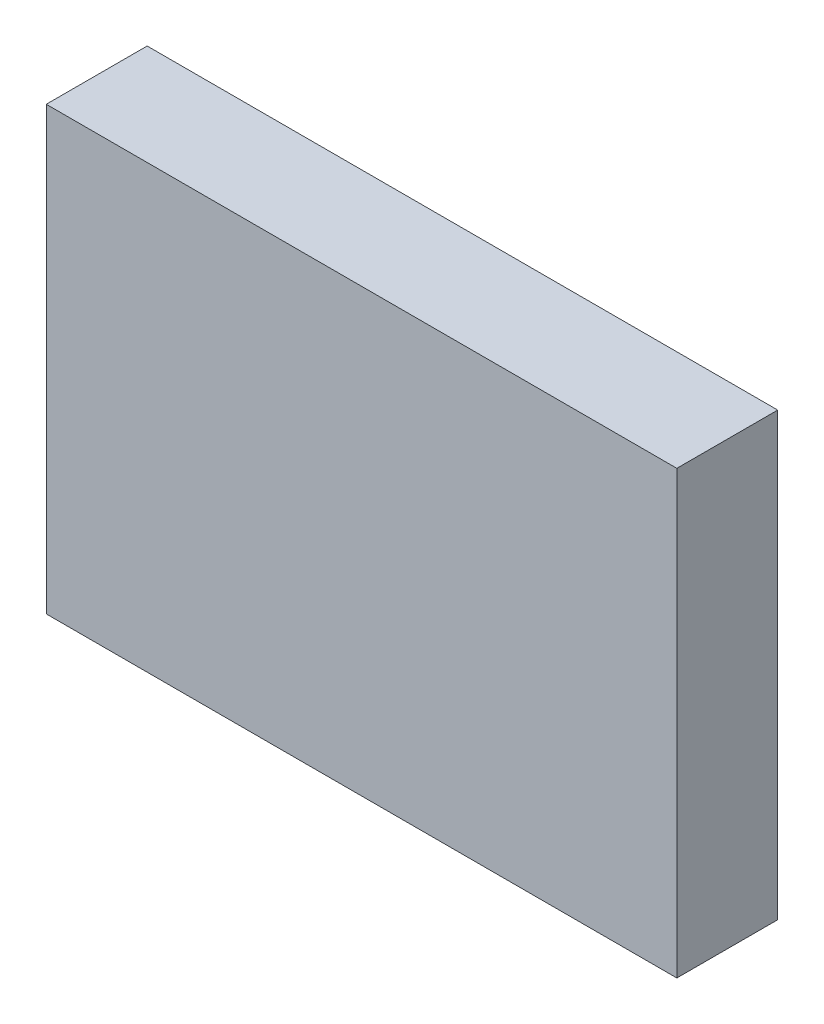
ISO-10303-21;
HEADER;
FILE_DESCRIPTION(('STEP AP214'),'2;1');
FILE_NAME('part.step','',(''),(''),'','','');
FILE_SCHEMA(('AUTOMOTIVE_DESIGN { 1 0 10303 214 1 1 1 1 }'));
ENDSEC;
DATA;
#1=APPLICATION_CONTEXT('core data for automotive mechanical design processes');
#2=APPLICATION_PROTOCOL_DEFINITION('international standard','automotive_design',2000,#1);
#3=PRODUCT_CONTEXT('',#1,'mechanical');
#4=PRODUCT('Part','Part','',(#3));
#5=PRODUCT_RELATED_PRODUCT_CATEGORY('part','',(#4));
#6=PRODUCT_DEFINITION_FORMATION('','',#4);
#7=PRODUCT_DEFINITION_CONTEXT('part definition',#1,'design');
#8=PRODUCT_DEFINITION('design','',#6,#7);
#9=PRODUCT_DEFINITION_SHAPE('','',#8);
#10=(LENGTH_UNIT() NAMED_UNIT(*) SI_UNIT(.MILLI.,.METRE.));
#11=(NAMED_UNIT(*) PLANE_ANGLE_UNIT() SI_UNIT($,.RADIAN.));
#12=(NAMED_UNIT(*) SI_UNIT($,.STERADIAN.) SOLID_ANGLE_UNIT());
#13=UNCERTAINTY_MEASURE_WITH_UNIT(LENGTH_MEASURE(1.E-05),#10,'distance_accuracy_value','');
#14=(GEOMETRIC_REPRESENTATION_CONTEXT(3) GLOBAL_UNCERTAINTY_ASSIGNED_CONTEXT((#13)) GLOBAL_UNIT_ASSIGNED_CONTEXT((#10,
#11,#12)) REPRESENTATION_CONTEXT('',''));
#15=CARTESIAN_POINT('',(0.,0.,0.));
#16=DIRECTION('',(0.,0.,1.));
#17=DIRECTION('',(1.,0.,0.));
#18=AXIS2_PLACEMENT_3D('',#15,#16,#17);
#19=CARTESIAN_POINT('',(0.,0.,0.05));
#20=DIRECTION('',(0.,0.,1.));
#21=DIRECTION('',(1.,0.,0.));
#22=AXIS2_PLACEMENT_3D('',#19,#20,#21);
#23=PLANE('',#22);
#24=DIRECTION('',(0.,1.,0.));
#25=VECTOR('',#24,1.);
#26=CARTESIAN_POINT('',(1.25,-0.875,0.05));
#27=LINE('',#26,#25);
#28=CARTESIAN_POINT('',(1.25,-0.875,0.05));
#29=VERTEX_POINT('',#28);
#30=CARTESIAN_POINT('',(1.25,0.875,0.05));
#31=VERTEX_POINT('',#30);
#32=EDGE_CURVE('E20',#29,#31,#27,.T.);
#33=ORIENTED_EDGE('',*,*,#32,.F.);
#34=DIRECTION('',(1.,0.,0.));
#35=VECTOR('',#34,1.);
#36=CARTESIAN_POINT('',(-1.25,-0.875,0.05));
#37=LINE('',#36,#35);
#38=CARTESIAN_POINT('',(-1.25,-0.875,0.05));
#39=VERTEX_POINT('',#38);
#40=EDGE_CURVE('E83',#39,#29,#37,.T.);
#41=ORIENTED_EDGE('',*,*,#40,.F.);
#42=DIRECTION('',(0.,-1.,0.));
#43=VECTOR('',#42,1.);
#44=CARTESIAN_POINT('',(-1.25,0.875,0.05));
#45=LINE('',#44,#43);
#46=CARTESIAN_POINT('',(-1.25,0.875,0.05));
#47=VERTEX_POINT('',#46);
#48=EDGE_CURVE('E65',#47,#39,#45,.T.);
#49=ORIENTED_EDGE('',*,*,#48,.F.);
#50=DIRECTION('',(-1.,0.,0.));
#51=VECTOR('',#50,1.);
#52=CARTESIAN_POINT('',(1.25,0.875,0.05));
#53=LINE('',#52,#51);
#54=EDGE_CURVE('E104',#31,#47,#53,.T.);
#55=ORIENTED_EDGE('',*,*,#54,.F.);
#56=EDGE_LOOP('',(#33,#41,#49,#55));
#57=FACE_BOUND('',#56,.T.);
#58=ADVANCED_FACE('F16',(#57),#23,.F.);
#59=CARTESIAN_POINT('',(0.,0.,0.45));
#60=DIRECTION('',(0.,0.,1.));
#61=DIRECTION('',(1.,0.,0.));
#62=AXIS2_PLACEMENT_3D('',#59,#60,#61);
#63=PLANE('',#62);
#64=DIRECTION('',(0.,1.,0.));
#65=VECTOR('',#64,1.);
#66=CARTESIAN_POINT('',(1.25,-0.875,0.45));
#67=LINE('',#66,#65);
#68=CARTESIAN_POINT('',(1.25,-0.875,0.45));
#69=VERTEX_POINT('',#68);
#70=CARTESIAN_POINT('',(1.25,0.875,0.45));
#71=VERTEX_POINT('',#70);
#72=EDGE_CURVE('E11',#69,#71,#67,.T.);
#73=ORIENTED_EDGE('',*,*,#72,.T.);
#74=DIRECTION('',(-1.,0.,0.));
#75=VECTOR('',#74,1.);
#76=CARTESIAN_POINT('',(1.25,0.875,0.45));
#77=LINE('',#76,#75);
#78=CARTESIAN_POINT('',(-1.25,0.875,0.45));
#79=VERTEX_POINT('',#78);
#80=EDGE_CURVE('E110',#71,#79,#77,.T.);
#81=ORIENTED_EDGE('',*,*,#80,.T.);
#82=DIRECTION('',(0.,-1.,0.));
#83=VECTOR('',#82,1.);
#84=CARTESIAN_POINT('',(-1.25,0.875,0.45));
#85=LINE('',#84,#83);
#86=CARTESIAN_POINT('',(-1.25,-0.875,0.45));
#87=VERTEX_POINT('',#86);
#88=EDGE_CURVE('E77',#79,#87,#85,.T.);
#89=ORIENTED_EDGE('',*,*,#88,.T.);
#90=DIRECTION('',(1.,0.,0.));
#91=VECTOR('',#90,1.);
#92=CARTESIAN_POINT('',(-1.25,-0.875,0.45));
#93=LINE('',#92,#91);
#94=EDGE_CURVE('E84',#87,#69,#93,.T.);
#95=ORIENTED_EDGE('',*,*,#94,.T.);
#96=EDGE_LOOP('',(#73,#81,#89,#95));
#97=FACE_BOUND('',#96,.T.);
#98=ADVANCED_FACE('F134',(#97),#63,.T.);
#99=CARTESIAN_POINT('',(1.25,-0.875,0.05));
#100=DIRECTION('',(1.,0.,0.));
#101=DIRECTION('',(0.,1.,0.));
#102=AXIS2_PLACEMENT_3D('',#99,#100,#101);
#103=PLANE('',#102);
#104=ORIENTED_EDGE('',*,*,#32,.T.);
#105=DIRECTION('',(0.,0.,1.));
#106=VECTOR('',#105,1.);
#107=CARTESIAN_POINT('',(1.25,0.875,0.05));
#108=LINE('',#107,#106);
#109=EDGE_CURVE('E97',#31,#71,#108,.T.);
#110=ORIENTED_EDGE('',*,*,#109,.T.);
#111=ORIENTED_EDGE('',*,*,#72,.F.);
#112=DIRECTION('',(0.,0.,1.));
#113=VECTOR('',#112,1.);
#114=CARTESIAN_POINT('',(1.25,-0.875,0.05));
#115=LINE('',#114,#113);
#116=EDGE_CURVE('E89',#29,#69,#115,.T.);
#117=ORIENTED_EDGE('',*,*,#116,.F.);
#118=EDGE_LOOP('',(#104,#110,#111,#117));
#119=FACE_BOUND('',#118,.T.);
#120=ADVANCED_FACE('F126',(#119),#103,.T.);
#121=CARTESIAN_POINT('',(1.25,0.875,0.05));
#122=DIRECTION('',(0.,1.,0.));
#123=DIRECTION('',(1.,0.,0.));
#124=AXIS2_PLACEMENT_3D('',#121,#122,#123);
#125=PLANE('',#124);
#126=ORIENTED_EDGE('',*,*,#54,.T.);
#127=DIRECTION('',(0.,0.,1.));
#128=VECTOR('',#127,1.);
#129=CARTESIAN_POINT('',(-1.25,0.875,0.05));
#130=LINE('',#129,#128);
#131=EDGE_CURVE('E72',#47,#79,#130,.T.);
#132=ORIENTED_EDGE('',*,*,#131,.T.);
#133=ORIENTED_EDGE('',*,*,#80,.F.);
#134=ORIENTED_EDGE('',*,*,#109,.F.);
#135=EDGE_LOOP('',(#126,#132,#133,#134));
#136=FACE_BOUND('',#135,.T.);
#137=ADVANCED_FACE('F18',(#136),#125,.T.);
#138=CARTESIAN_POINT('',(-1.25,0.875,0.05));
#139=DIRECTION('',(-1.,0.,0.));
#140=DIRECTION('',(0.,0.,1.));
#141=AXIS2_PLACEMENT_3D('',#138,#139,#140);
#142=PLANE('',#141);
#143=ORIENTED_EDGE('',*,*,#48,.T.);
#144=DIRECTION('',(0.,0.,1.));
#145=VECTOR('',#144,1.);
#146=CARTESIAN_POINT('',(-1.25,-0.875,0.05));
#147=LINE('',#146,#145);
#148=EDGE_CURVE('E69',#39,#87,#147,.T.);
#149=ORIENTED_EDGE('',*,*,#148,.T.);
#150=ORIENTED_EDGE('',*,*,#88,.F.);
#151=ORIENTED_EDGE('',*,*,#131,.F.);
#152=EDGE_LOOP('',(#143,#149,#150,#151));
#153=FACE_BOUND('',#152,.T.);
#154=ADVANCED_FACE('F67',(#153),#142,.T.);
#155=CARTESIAN_POINT('',(-1.25,-0.875,0.05));
#156=DIRECTION('',(0.,-1.,0.));
#157=DIRECTION('',(0.,0.,-1.));
#158=AXIS2_PLACEMENT_3D('',#155,#156,#157);
#159=PLANE('',#158);
#160=ORIENTED_EDGE('',*,*,#40,.T.);
#161=ORIENTED_EDGE('',*,*,#116,.T.);
#162=ORIENTED_EDGE('',*,*,#94,.F.);
#163=ORIENTED_EDGE('',*,*,#148,.F.);
#164=EDGE_LOOP('',(#160,#161,#162,#163));
#165=FACE_BOUND('',#164,.T.);
#166=ADVANCED_FACE('F81',(#165),#159,.T.);
#167=CLOSED_SHELL('',(#58,#98,#120,#137,#154,#166));
#168=MANIFOLD_SOLID_BREP('B1',#167);
#169=ADVANCED_BREP_SHAPE_REPRESENTATION('',(#18,#168),#14);
#170=SHAPE_DEFINITION_REPRESENTATION(#9,#169);
ENDSEC;
END-ISO-10303-21;
